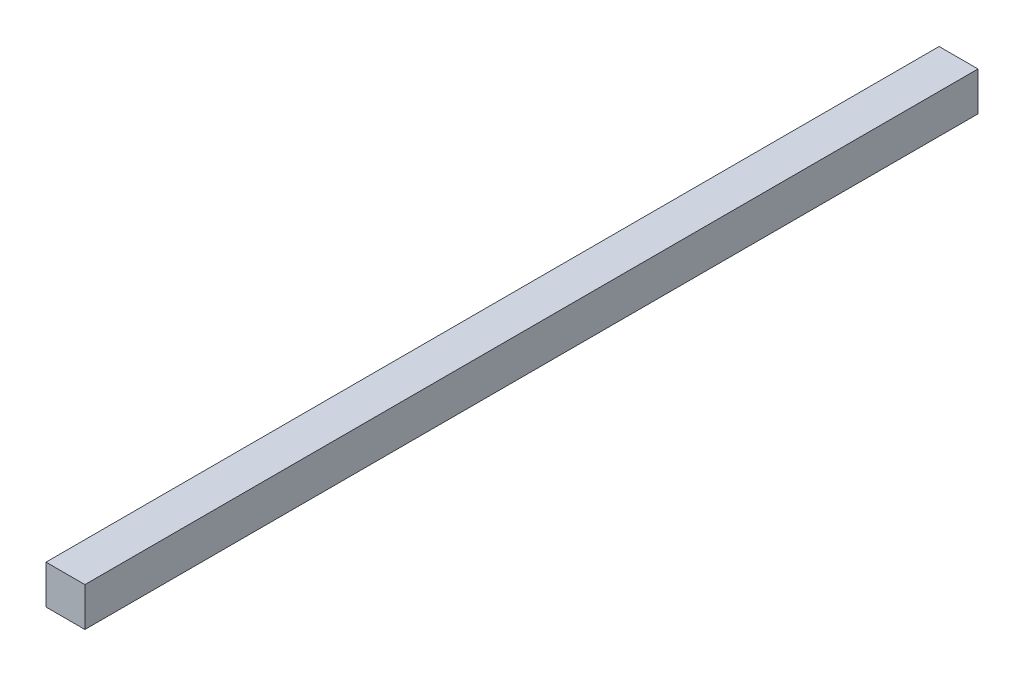
ISO-10303-21;
HEADER;
FILE_DESCRIPTION(('STEP AP214'),'2;1');
FILE_NAME('part.step','',(''),(''),'','','');
FILE_SCHEMA(('AUTOMOTIVE_DESIGN { 1 0 10303 214 1 1 1 1 }'));
ENDSEC;
DATA;
#1=APPLICATION_CONTEXT('core data for automotive mechanical design processes');
#2=APPLICATION_PROTOCOL_DEFINITION('international standard','automotive_design',2000,#1);
#3=PRODUCT_CONTEXT('',#1,'mechanical');
#4=PRODUCT('Part','Part','',(#3));
#5=PRODUCT_RELATED_PRODUCT_CATEGORY('part','',(#4));
#6=PRODUCT_DEFINITION_FORMATION('','',#4);
#7=PRODUCT_DEFINITION_CONTEXT('part definition',#1,'design');
#8=PRODUCT_DEFINITION('design','',#6,#7);
#9=PRODUCT_DEFINITION_SHAPE('','',#8);
#10=(LENGTH_UNIT() NAMED_UNIT(*) SI_UNIT(.MILLI.,.METRE.));
#11=(NAMED_UNIT(*) PLANE_ANGLE_UNIT() SI_UNIT($,.RADIAN.));
#12=(NAMED_UNIT(*) SI_UNIT($,.STERADIAN.) SOLID_ANGLE_UNIT());
#13=UNCERTAINTY_MEASURE_WITH_UNIT(LENGTH_MEASURE(1.E-05),#10,'distance_accuracy_value','');
#14=(GEOMETRIC_REPRESENTATION_CONTEXT(3) GLOBAL_UNCERTAINTY_ASSIGNED_CONTEXT((#13)) GLOBAL_UNIT_ASSIGNED_CONTEXT((#10,
#11,#12)) REPRESENTATION_CONTEXT('',''));
#15=CARTESIAN_POINT('',(0.,0.,0.));
#16=DIRECTION('',(0.,0.,1.));
#17=DIRECTION('',(1.,0.,0.));
#18=AXIS2_PLACEMENT_3D('',#15,#16,#17);
#19=CARTESIAN_POINT('',(-5.,5.,229.597));
#20=DIRECTION('',(1.,0.,0.));
#21=DIRECTION('',(0.,1.,0.));
#22=AXIS2_PLACEMENT_3D('',#19,#20,#21);
#23=PLANE('',#22);
#24=DIRECTION('',(0.,-1.,0.));
#25=VECTOR('',#24,1.);
#26=CARTESIAN_POINT('',(-5.,5.,0.));
#27=LINE('',#26,#25);
#28=CARTESIAN_POINT('',(-5.,5.,0.));
#29=VERTEX_POINT('',#28);
#30=CARTESIAN_POINT('',(-5.,-5.,0.));
#31=VERTEX_POINT('',#30);
#32=EDGE_CURVE('E96',#29,#31,#27,.T.);
#33=ORIENTED_EDGE('',*,*,#32,.T.);
#34=DIRECTION('',(0.,0.,-1.));
#35=VECTOR('',#34,1.);
#36=CARTESIAN_POINT('',(-5.,-5.,229.597));
#37=LINE('',#36,#35);
#38=CARTESIAN_POINT('',(-5.,-5.,229.597));
#39=VERTEX_POINT('',#38);
#40=EDGE_CURVE('E11',#39,#31,#37,.T.);
#41=ORIENTED_EDGE('',*,*,#40,.F.);
#42=DIRECTION('',(0.,-1.,0.));
#43=VECTOR('',#42,1.);
#44=CARTESIAN_POINT('',(-5.,5.,229.597));
#45=LINE('',#44,#43);
#46=CARTESIAN_POINT('',(-5.,5.,229.597));
#47=VERTEX_POINT('',#46);
#48=EDGE_CURVE('E84',#47,#39,#45,.T.);
#49=ORIENTED_EDGE('',*,*,#48,.F.);
#50=DIRECTION('',(0.,0.,-1.));
#51=VECTOR('',#50,1.);
#52=CARTESIAN_POINT('',(-5.,5.,229.597));
#53=LINE('',#52,#51);
#54=EDGE_CURVE('E92',#47,#29,#53,.T.);
#55=ORIENTED_EDGE('',*,*,#54,.T.);
#56=EDGE_LOOP('',(#33,#41,#49,#55));
#57=FACE_BOUND('',#56,.T.);
#58=ADVANCED_FACE('F33',(#57),#23,.F.);
#59=CARTESIAN_POINT('',(5.,-5.,229.597));
#60=DIRECTION('',(0.,1.,0.));
#61=DIRECTION('',(-1.,0.,0.));
#62=AXIS2_PLACEMENT_3D('',#59,#60,#61);
#63=PLANE('',#62);
#64=DIRECTION('',(1.,0.,0.));
#65=VECTOR('',#64,1.);
#66=CARTESIAN_POINT('',(5.,-5.,0.));
#67=LINE('',#66,#65);
#68=CARTESIAN_POINT('',(5.,-5.,0.));
#69=VERTEX_POINT('',#68);
#70=EDGE_CURVE('E88',#31,#69,#67,.T.);
#71=ORIENTED_EDGE('',*,*,#70,.T.);
#72=DIRECTION('',(0.,0.,-1.));
#73=VECTOR('',#72,1.);
#74=CARTESIAN_POINT('',(5.,-5.,229.597));
#75=LINE('',#74,#73);
#76=CARTESIAN_POINT('',(5.,-5.,229.597));
#77=VERTEX_POINT('',#76);
#78=EDGE_CURVE('E41',#77,#69,#75,.T.);
#79=ORIENTED_EDGE('',*,*,#78,.F.);
#80=DIRECTION('',(1.,0.,0.));
#81=VECTOR('',#80,1.);
#82=CARTESIAN_POINT('',(5.,-5.,229.597));
#83=LINE('',#82,#81);
#84=EDGE_CURVE('E79',#39,#77,#83,.T.);
#85=ORIENTED_EDGE('',*,*,#84,.F.);
#86=ORIENTED_EDGE('',*,*,#40,.T.);
#87=EDGE_LOOP('',(#71,#79,#85,#86));
#88=FACE_BOUND('',#87,.T.);
#89=ADVANCED_FACE('F87',(#88),#63,.F.);
#90=CARTESIAN_POINT('',(5.,5.,229.597));
#91=DIRECTION('',(-1.,0.,0.));
#92=DIRECTION('',(0.,-1.,0.));
#93=AXIS2_PLACEMENT_3D('',#90,#91,#92);
#94=PLANE('',#93);
#95=DIRECTION('',(0.,1.,0.));
#96=VECTOR('',#95,1.);
#97=CARTESIAN_POINT('',(5.,5.,0.));
#98=LINE('',#97,#96);
#99=CARTESIAN_POINT('',(5.,5.,0.));
#100=VERTEX_POINT('',#99);
#101=EDGE_CURVE('E66',#69,#100,#98,.T.);
#102=ORIENTED_EDGE('',*,*,#101,.T.);
#103=DIRECTION('',(0.,0.,-1.));
#104=VECTOR('',#103,1.);
#105=CARTESIAN_POINT('',(5.,5.,229.597));
#106=LINE('',#105,#104);
#107=CARTESIAN_POINT('',(5.,5.,229.597));
#108=VERTEX_POINT('',#107);
#109=EDGE_CURVE('E89',#108,#100,#106,.T.);
#110=ORIENTED_EDGE('',*,*,#109,.F.);
#111=DIRECTION('',(0.,1.,0.));
#112=VECTOR('',#111,1.);
#113=CARTESIAN_POINT('',(5.,5.,229.597));
#114=LINE('',#113,#112);
#115=EDGE_CURVE('E82',#77,#108,#114,.T.);
#116=ORIENTED_EDGE('',*,*,#115,.F.);
#117=ORIENTED_EDGE('',*,*,#78,.T.);
#118=EDGE_LOOP('',(#102,#110,#116,#117));
#119=FACE_BOUND('',#118,.T.);
#120=ADVANCED_FACE('F90',(#119),#94,.F.);
#121=CARTESIAN_POINT('',(5.,5.,229.597));
#122=DIRECTION('',(0.,-1.,0.));
#123=DIRECTION('',(1.,0.,0.));
#124=AXIS2_PLACEMENT_3D('',#121,#122,#123);
#125=PLANE('',#124);
#126=DIRECTION('',(-1.,0.,0.));
#127=VECTOR('',#126,1.);
#128=CARTESIAN_POINT('',(5.,5.,0.));
#129=LINE('',#128,#127);
#130=EDGE_CURVE('E72',#100,#29,#129,.T.);
#131=ORIENTED_EDGE('',*,*,#130,.T.);
#132=ORIENTED_EDGE('',*,*,#54,.F.);
#133=DIRECTION('',(-1.,0.,0.));
#134=VECTOR('',#133,1.);
#135=CARTESIAN_POINT('',(5.,5.,229.597));
#136=LINE('',#135,#134);
#137=EDGE_CURVE('E49',#108,#47,#136,.T.);
#138=ORIENTED_EDGE('',*,*,#137,.F.);
#139=ORIENTED_EDGE('',*,*,#109,.T.);
#140=EDGE_LOOP('',(#131,#132,#138,#139));
#141=FACE_BOUND('',#140,.T.);
#142=ADVANCED_FACE('F103',(#141),#125,.F.);
#143=CARTESIAN_POINT('',(0.,0.,229.597));
#144=DIRECTION('',(0.,0.,-1.));
#145=DIRECTION('',(-1.,0.,0.));
#146=AXIS2_PLACEMENT_3D('',#143,#144,#145);
#147=PLANE('',#146);
#148=ORIENTED_EDGE('',*,*,#48,.T.);
#149=ORIENTED_EDGE('',*,*,#84,.T.);
#150=ORIENTED_EDGE('',*,*,#115,.T.);
#151=ORIENTED_EDGE('',*,*,#137,.T.);
#152=EDGE_LOOP('',(#148,#149,#150,#151));
#153=FACE_BOUND('',#152,.T.);
#154=ADVANCED_FACE('F80',(#153),#147,.F.);
#155=CARTESIAN_POINT('',(0.,0.,0.));
#156=DIRECTION('',(0.,0.,-1.));
#157=DIRECTION('',(-1.,0.,0.));
#158=AXIS2_PLACEMENT_3D('',#155,#156,#157);
#159=PLANE('',#158);
#160=ORIENTED_EDGE('',*,*,#32,.F.);
#161=ORIENTED_EDGE('',*,*,#130,.F.);
#162=ORIENTED_EDGE('',*,*,#101,.F.);
#163=ORIENTED_EDGE('',*,*,#70,.F.);
#164=EDGE_LOOP('',(#160,#161,#162,#163));
#165=FACE_BOUND('',#164,.T.);
#166=ADVANCED_FACE('F106',(#165),#159,.T.);
#167=CLOSED_SHELL('',(#58,#89,#120,#142,#154,#166));
#168=MANIFOLD_SOLID_BREP('B2',#167);
#169=ADVANCED_BREP_SHAPE_REPRESENTATION('',(#18,#168),#14);
#170=SHAPE_DEFINITION_REPRESENTATION(#9,#169);
ENDSEC;
END-ISO-10303-21;
